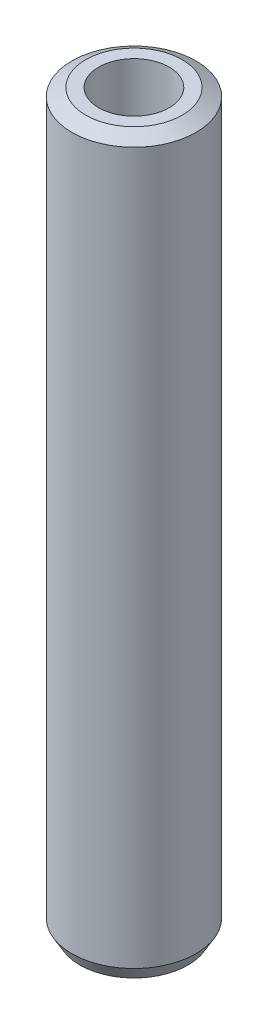
ISO-10303-21;
HEADER;
FILE_DESCRIPTION(('STEP AP214'),'2;1');
FILE_NAME('part.step','',(''),(''),'','','');
FILE_SCHEMA(('AUTOMOTIVE_DESIGN { 1 0 10303 214 1 1 1 1 }'));
ENDSEC;
DATA;
#1=APPLICATION_CONTEXT('core data for automotive mechanical design processes');
#2=APPLICATION_PROTOCOL_DEFINITION('international standard','automotive_design',2000,#1);
#3=PRODUCT_CONTEXT('',#1,'mechanical');
#4=PRODUCT('Part','Part','',(#3));
#5=PRODUCT_RELATED_PRODUCT_CATEGORY('part','',(#4));
#6=PRODUCT_DEFINITION_FORMATION('','',#4);
#7=PRODUCT_DEFINITION_CONTEXT('part definition',#1,'design');
#8=PRODUCT_DEFINITION('design','',#6,#7);
#9=PRODUCT_DEFINITION_SHAPE('','',#8);
#10=(LENGTH_UNIT() NAMED_UNIT(*) SI_UNIT(.MILLI.,.METRE.));
#11=(NAMED_UNIT(*) PLANE_ANGLE_UNIT() SI_UNIT($,.RADIAN.));
#12=(NAMED_UNIT(*) SI_UNIT($,.STERADIAN.) SOLID_ANGLE_UNIT());
#13=UNCERTAINTY_MEASURE_WITH_UNIT(LENGTH_MEASURE(1.E-05),#10,'distance_accuracy_value','');
#14=(GEOMETRIC_REPRESENTATION_CONTEXT(3) GLOBAL_UNCERTAINTY_ASSIGNED_CONTEXT((#13)) GLOBAL_UNIT_ASSIGNED_CONTEXT((#10,
#11,#12)) REPRESENTATION_CONTEXT('',''));
#15=CARTESIAN_POINT('',(0.,0.,0.));
#16=DIRECTION('',(0.,0.,1.));
#17=DIRECTION('',(1.,0.,0.));
#18=AXIS2_PLACEMENT_3D('',#15,#16,#17);
#19=CARTESIAN_POINT('',(0.,384.083358423333,0.));
#20=DIRECTION('',(0.,-1.,0.));
#21=DIRECTION('',(0.,0.,-1.));
#22=AXIS2_PLACEMENT_3D('',#19,#20,#21);
#23=CYLINDRICAL_SURFACE('',#22,32.5);
#24=CARTESIAN_POINT('',(0.,379.890119931504,0.));
#25=DIRECTION('',(0.,1.,0.));
#26=DIRECTION('',(0.,0.,1.));
#27=AXIS2_PLACEMENT_3D('',#24,#25,#26);
#28=CIRCLE('',#27,32.5);
#29=CARTESIAN_POINT('',(0.,379.890119931504,32.5));
#30=VERTEX_POINT('',#29);
#31=EDGE_CURVE('E50',#30,#30,#28,.F.);
#32=ORIENTED_EDGE('',*,*,#31,.T.);
#33=EDGE_LOOP('',(#32));
#34=FACE_BOUND('',#33,.T.);
#35=CARTESIAN_POINT('',(0.,7.26290211610159,0.));
#36=DIRECTION('',(0.,1.,0.));
#37=DIRECTION('',(0.,0.,1.));
#38=AXIS2_PLACEMENT_3D('',#35,#36,#37);
#39=CIRCLE('',#38,32.5);
#40=CARTESIAN_POINT('',(0.,7.26290211610159,32.5));
#41=VERTEX_POINT('',#40);
#42=EDGE_CURVE('E51',#41,#41,#39,.T.);
#43=ORIENTED_EDGE('',*,*,#42,.T.);
#44=EDGE_LOOP('',(#43));
#45=FACE_BOUND('',#44,.T.);
#46=ADVANCED_FACE('F39',(#34,#45),#23,.T.);
#47=CARTESIAN_POINT('',(0.,384.083358423333,0.));
#48=DIRECTION('',(0.,1.,0.));
#49=DIRECTION('',(0.,0.,1.));
#50=AXIS2_PLACEMENT_3D('',#47,#48,#49);
#51=PLANE('',#50);
#52=CARTESIAN_POINT('',(0.,384.083358423333,0.));
#53=DIRECTION('',(0.,1.,0.));
#54=DIRECTION('',(0.,0.,1.));
#55=AXIS2_PLACEMENT_3D('',#52,#53,#54);
#56=CIRCLE('',#55,25.2370978838986);
#57=CARTESIAN_POINT('',(0.,384.083358423333,25.2370978838986));
#58=VERTEX_POINT('',#57);
#59=EDGE_CURVE('E54',#58,#58,#56,.T.);
#60=ORIENTED_EDGE('',*,*,#59,.T.);
#61=EDGE_LOOP('',(#60));
#62=FACE_BOUND('',#61,.T.);
#63=CARTESIAN_POINT('',(0.,384.083358423333,0.));
#64=DIRECTION('',(0.,1.,0.));
#65=DIRECTION('',(0.,0.,1.));
#66=AXIS2_PLACEMENT_3D('',#63,#64,#65);
#67=CIRCLE('',#66,18.4758330507357);
#68=CARTESIAN_POINT('',(0.,384.083358423333,18.4758330507357));
#69=VERTEX_POINT('',#68);
#70=EDGE_CURVE('E58',#69,#69,#67,.T.);
#71=ORIENTED_EDGE('',*,*,#70,.F.);
#72=EDGE_LOOP('',(#71));
#73=FACE_BOUND('',#72,.T.);
#74=ADVANCED_FACE('F69',(#62,#73),#51,.T.);
#75=CARTESIAN_POINT('',(0.,0.,0.));
#76=DIRECTION('',(0.,1.,0.));
#77=DIRECTION('',(0.,0.,1.));
#78=AXIS2_PLACEMENT_3D('',#75,#76,#77);
#79=PLANE('',#78);
#80=CARTESIAN_POINT('',(0.,0.,0.));
#81=DIRECTION('',(0.,1.,0.));
#82=DIRECTION('',(0.,0.,1.));
#83=AXIS2_PLACEMENT_3D('',#80,#81,#82);
#84=CIRCLE('',#83,28.3067615081708);
#85=CARTESIAN_POINT('',(0.,0.,28.3067615081708));
#86=VERTEX_POINT('',#85);
#87=EDGE_CURVE('E10',#86,#86,#84,.F.);
#88=ORIENTED_EDGE('',*,*,#87,.T.);
#89=EDGE_LOOP('',(#88));
#90=FACE_BOUND('',#89,.T.);
#91=CARTESIAN_POINT('',(0.,0.,0.));
#92=DIRECTION('',(0.,1.,0.));
#93=DIRECTION('',(0.,0.,1.));
#94=AXIS2_PLACEMENT_3D('',#91,#92,#93);
#95=CIRCLE('',#94,18.4758330507357);
#96=CARTESIAN_POINT('',(0.,0.,18.4758330507357));
#97=VERTEX_POINT('',#96);
#98=EDGE_CURVE('E63',#97,#97,#95,.T.);
#99=ORIENTED_EDGE('',*,*,#98,.T.);
#100=EDGE_LOOP('',(#99));
#101=FACE_BOUND('',#100,.T.);
#102=ADVANCED_FACE('F75',(#90,#101),#79,.F.);
#103=CARTESIAN_POINT('',(0.,384.083358423333,0.));
#104=DIRECTION('',(0.,-1.,0.));
#105=DIRECTION('',(0.,0.,-1.));
#106=AXIS2_PLACEMENT_3D('',#103,#104,#105);
#107=CYLINDRICAL_SURFACE('',#106,18.4758330507357);
#108=ORIENTED_EDGE('',*,*,#70,.T.);
#109=EDGE_LOOP('',(#108));
#110=FACE_BOUND('',#109,.T.);
#111=ORIENTED_EDGE('',*,*,#98,.F.);
#112=EDGE_LOOP('',(#111));
#113=FACE_BOUND('',#112,.T.);
#114=ADVANCED_FACE('F70',(#110,#113),#107,.F.);
#115=CARTESIAN_POINT('',(0.,384.083358423333,0.));
#116=DIRECTION('',(0.,-1.,0.));
#117=DIRECTION('',(0.,0.,-1.));
#118=AXIS2_PLACEMENT_3D('',#115,#116,#117);
#119=CONICAL_SURFACE('',#118,25.2370978838986,1.0471975511966);
#120=ORIENTED_EDGE('',*,*,#31,.F.);
#121=EDGE_LOOP('',(#120));
#122=FACE_BOUND('',#121,.T.);
#123=ORIENTED_EDGE('',*,*,#59,.F.);
#124=EDGE_LOOP('',(#123));
#125=FACE_BOUND('',#124,.T.);
#126=ADVANCED_FACE('F81',(#122,#125),#119,.T.);
#127=CARTESIAN_POINT('',(0.,7.26290211610159,0.));
#128=DIRECTION('',(0.,1.,0.));
#129=DIRECTION('',(0.,0.,1.));
#130=AXIS2_PLACEMENT_3D('',#127,#128,#129);
#131=CONICAL_SURFACE('',#130,32.5,0.523598775598304);
#132=ORIENTED_EDGE('',*,*,#87,.F.);
#133=EDGE_LOOP('',(#132));
#134=FACE_BOUND('',#133,.T.);
#135=ORIENTED_EDGE('',*,*,#42,.F.);
#136=EDGE_LOOP('',(#135));
#137=FACE_BOUND('',#136,.T.);
#138=ADVANCED_FACE('F45',(#134,#137),#131,.T.);
#139=CLOSED_SHELL('',(#46,#74,#102,#114,#126,#138));
#140=MANIFOLD_SOLID_BREP('B2',#139);
#141=ADVANCED_BREP_SHAPE_REPRESENTATION('',(#18,#140),#14);
#142=SHAPE_DEFINITION_REPRESENTATION(#9,#141);
ENDSEC;
END-ISO-10303-21;
